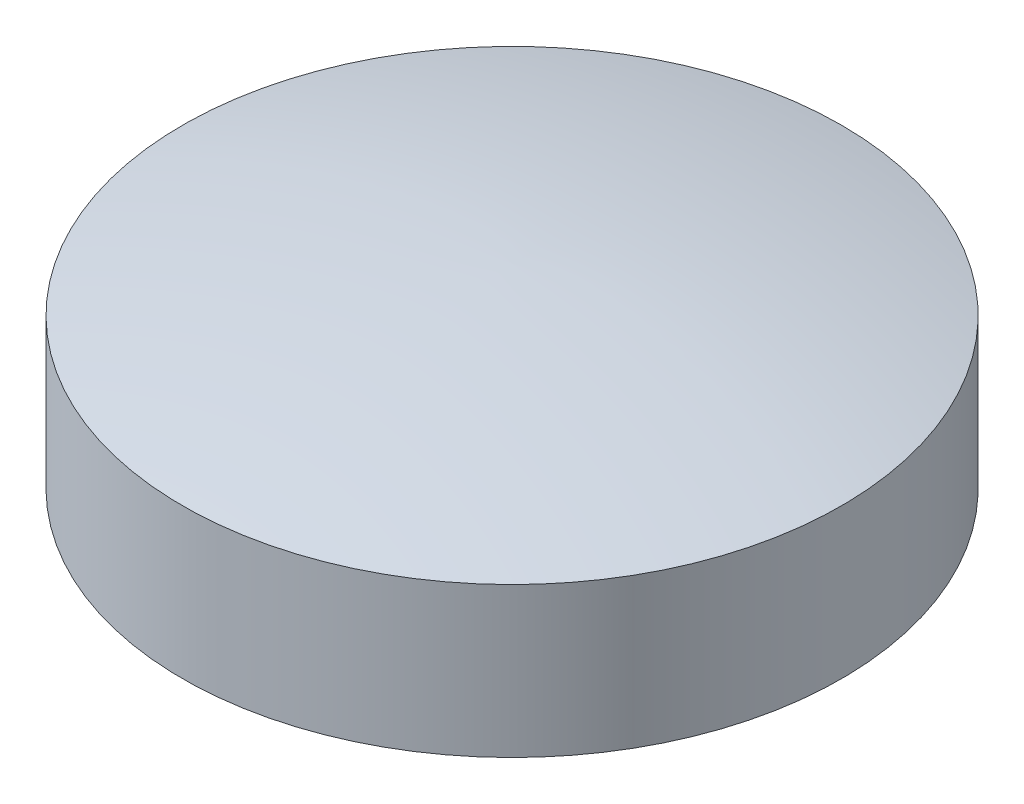
ISO-10303-21;
HEADER;
FILE_DESCRIPTION(('STEP AP214'),'2;1');
FILE_NAME('part.step','',(''),(''),'','','');
FILE_SCHEMA(('AUTOMOTIVE_DESIGN { 1 0 10303 214 1 1 1 1 }'));
ENDSEC;
DATA;
#1=APPLICATION_CONTEXT('core data for automotive mechanical design processes');
#2=APPLICATION_PROTOCOL_DEFINITION('international standard','automotive_design',2000,#1);
#3=PRODUCT_CONTEXT('',#1,'mechanical');
#4=PRODUCT('Part','Part','',(#3));
#5=PRODUCT_RELATED_PRODUCT_CATEGORY('part','',(#4));
#6=PRODUCT_DEFINITION_FORMATION('','',#4);
#7=PRODUCT_DEFINITION_CONTEXT('part definition',#1,'design');
#8=PRODUCT_DEFINITION('design','',#6,#7);
#9=PRODUCT_DEFINITION_SHAPE('','',#8);
#10=(LENGTH_UNIT() NAMED_UNIT(*) SI_UNIT(.MILLI.,.METRE.));
#11=(NAMED_UNIT(*) PLANE_ANGLE_UNIT() SI_UNIT($,.RADIAN.));
#12=(NAMED_UNIT(*) SI_UNIT($,.STERADIAN.) SOLID_ANGLE_UNIT());
#13=UNCERTAINTY_MEASURE_WITH_UNIT(LENGTH_MEASURE(1.E-05),#10,'distance_accuracy_value','');
#14=(GEOMETRIC_REPRESENTATION_CONTEXT(3) GLOBAL_UNCERTAINTY_ASSIGNED_CONTEXT((#13)) GLOBAL_UNIT_ASSIGNED_CONTEXT((#10,
#11,#12)) REPRESENTATION_CONTEXT('',''));
#15=CARTESIAN_POINT('',(0.,0.,0.));
#16=DIRECTION('',(0.,0.,1.));
#17=DIRECTION('',(1.,0.,0.));
#18=AXIS2_PLACEMENT_3D('',#15,#16,#17);
#19=CARTESIAN_POINT('',(0.,-80.1809294196393,1.50194492085991));
#20=DIRECTION('',(-1.,0.,0.));
#21=DIRECTION('',(0.,0.,-1.));
#22=AXIS2_PLACEMENT_3D('',#19,#20,#21);
#23=CIRCLE('',#22,93.1930332484843);
#24=TRIMMED_CURVE('',#23,(PARAMETER_VALUE(-1.55467913545943)),
(PARAMETER_VALUE(1.55467913545943)),.T.,.PARAMETER.);
#25=CARTESIAN_POINT('',(0.,-80.1809294196393,0.));
#26=DIRECTION('',(0.,-1.,0.));
#27=AXIS1_PLACEMENT('',#25,#26);
#28=SURFACE_OF_REVOLUTION('',#24,#27);
#29=CARTESIAN_POINT('',(0.,13.,0.));
#30=VERTEX_POINT('',#29);
#31=VERTEX_LOOP('',#30);
#32=FACE_BOUND('',#31,.T.);
#33=CARTESIAN_POINT('',(0.,10.,0.));
#34=DIRECTION('',(0.,-1.,0.));
#35=DIRECTION('',(0.,0.,-1.));
#36=AXIS2_PLACEMENT_3D('',#33,#34,#35);
#37=CIRCLE('',#36,22.);
#38=CARTESIAN_POINT('',(0.,10.,-22.));
#39=VERTEX_POINT('',#38);
#40=EDGE_CURVE('E11',#39,#39,#37,.T.);
#41=ORIENTED_EDGE('',*,*,#40,.F.);
#42=EDGE_LOOP('',(#41));
#43=FACE_BOUND('',#42,.T.);
#44=ADVANCED_FACE('F33',(#32,#43),#28,.T.);
#45=CARTESIAN_POINT('',(0.,0.,0.));
#46=DIRECTION('',(0.,-1.,0.));
#47=DIRECTION('',(0.,0.,-1.));
#48=AXIS2_PLACEMENT_3D('',#45,#46,#47);
#49=CYLINDRICAL_SURFACE('',#48,22.);
#50=ORIENTED_EDGE('',*,*,#40,.T.);
#51=EDGE_LOOP('',(#50));
#52=FACE_BOUND('',#51,.T.);
#53=CARTESIAN_POINT('',(0.,0.,0.));
#54=DIRECTION('',(0.,-1.,0.));
#55=DIRECTION('',(0.,0.,-1.));
#56=AXIS2_PLACEMENT_3D('',#53,#54,#55);
#57=CIRCLE('',#56,22.);
#58=CARTESIAN_POINT('',(0.,0.,-22.));
#59=VERTEX_POINT('',#58);
#60=EDGE_CURVE('E39',#59,#59,#57,.T.);
#61=ORIENTED_EDGE('',*,*,#60,.F.);
#62=EDGE_LOOP('',(#61));
#63=FACE_BOUND('',#62,.T.);
#64=ADVANCED_FACE('F44',(#52,#63),#49,.T.);
#65=CARTESIAN_POINT('',(0.,0.,0.));
#66=DIRECTION('',(0.,-1.,0.));
#67=DIRECTION('',(0.,0.,-1.));
#68=AXIS2_PLACEMENT_3D('',#65,#66,#67);
#69=PLANE('',#68);
#70=ORIENTED_EDGE('',*,*,#60,.T.);
#71=EDGE_LOOP('',(#70));
#72=FACE_BOUND('',#71,.T.);
#73=ADVANCED_FACE('F49',(#72),#69,.T.);
#74=CLOSED_SHELL('',(#44,#64,#73));
#75=MANIFOLD_SOLID_BREP('B2',#74);
#76=ADVANCED_BREP_SHAPE_REPRESENTATION('',(#18,#75),#14);
#77=SHAPE_DEFINITION_REPRESENTATION(#9,#76);
ENDSEC;
END-ISO-10303-21;
